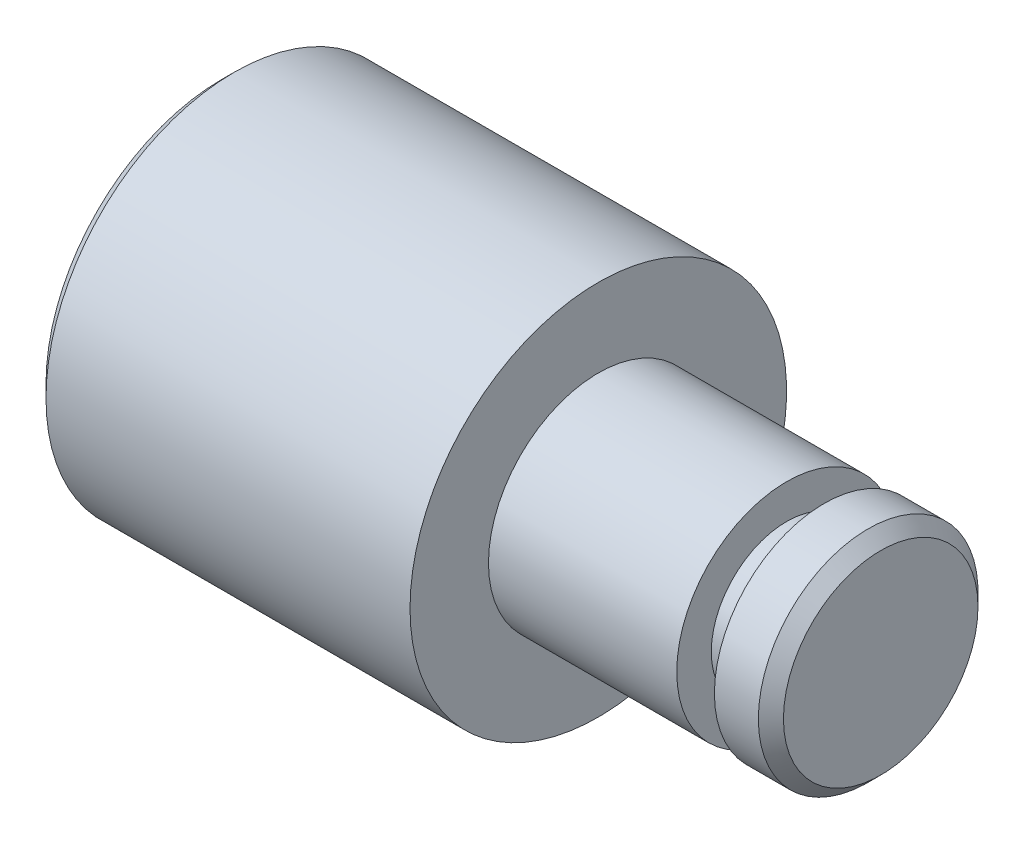
ISO-10303-21;
HEADER;
FILE_DESCRIPTION(('STEP AP214'),'2;1');
FILE_NAME('part.step','',(''),(''),'','','');
FILE_SCHEMA(('AUTOMOTIVE_DESIGN { 1 0 10303 214 1 1 1 1 }'));
ENDSEC;
DATA;
#1=APPLICATION_CONTEXT('core data for automotive mechanical design processes');
#2=APPLICATION_PROTOCOL_DEFINITION('international standard','automotive_design',2000,#1);
#3=PRODUCT_CONTEXT('',#1,'mechanical');
#4=PRODUCT('Part','Part','',(#3));
#5=PRODUCT_RELATED_PRODUCT_CATEGORY('part','',(#4));
#6=PRODUCT_DEFINITION_FORMATION('','',#4);
#7=PRODUCT_DEFINITION_CONTEXT('part definition',#1,'design');
#8=PRODUCT_DEFINITION('design','',#6,#7);
#9=PRODUCT_DEFINITION_SHAPE('','',#8);
#10=(LENGTH_UNIT() NAMED_UNIT(*) SI_UNIT(.MILLI.,.METRE.));
#11=(NAMED_UNIT(*) PLANE_ANGLE_UNIT() SI_UNIT($,.RADIAN.));
#12=(NAMED_UNIT(*) SI_UNIT($,.STERADIAN.) SOLID_ANGLE_UNIT());
#13=UNCERTAINTY_MEASURE_WITH_UNIT(LENGTH_MEASURE(1.E-05),#10,'distance_accuracy_value','');
#14=(GEOMETRIC_REPRESENTATION_CONTEXT(3) GLOBAL_UNCERTAINTY_ASSIGNED_CONTEXT((#13)) GLOBAL_UNIT_ASSIGNED_CONTEXT((#10,
#11,#12)) REPRESENTATION_CONTEXT('',''));
#15=CARTESIAN_POINT('',(0.,0.,0.));
#16=DIRECTION('',(0.,0.,1.));
#17=DIRECTION('',(1.,0.,0.));
#18=AXIS2_PLACEMENT_3D('',#15,#16,#17);
#19=CARTESIAN_POINT('',(0.,0.,0.));
#20=DIRECTION('',(-1.,0.,0.));
#21=DIRECTION('',(0.,0.,1.));
#22=AXIS2_PLACEMENT_3D('',#19,#20,#21);
#23=PLANE('',#22);
#24=CARTESIAN_POINT('',(0.,0.,0.));
#25=DIRECTION('',(-1.,0.,0.));
#26=DIRECTION('',(0.,0.,1.));
#27=AXIS2_PLACEMENT_3D('',#24,#25,#26);
#28=CIRCLE('',#27,1.55);
#29=CARTESIAN_POINT('',(0.,0.,1.55));
#30=VERTEX_POINT('',#29);
#31=EDGE_CURVE('E40',#30,#30,#28,.F.);
#32=ORIENTED_EDGE('',*,*,#31,.T.);
#33=EDGE_LOOP('',(#32));
#34=FACE_BOUND('',#33,.T.);
#35=ADVANCED_FACE('F30',(#34),#23,.F.);
#36=CARTESIAN_POINT('',(0.,0.,0.));
#37=DIRECTION('',(-1.,0.,0.));
#38=DIRECTION('',(0.,0.,1.));
#39=AXIS2_PLACEMENT_3D('',#36,#37,#38);
#40=CYLINDRICAL_SURFACE('',#39,1.75);
#41=CARTESIAN_POINT('',(-0.199999999999999,0.,0.));
#42=DIRECTION('',(-1.,0.,0.));
#43=DIRECTION('',(0.,0.,1.));
#44=AXIS2_PLACEMENT_3D('',#41,#42,#43);
#45=CIRCLE('',#44,1.75);
#46=CARTESIAN_POINT('',(-0.199999999999999,0.,1.75));
#47=VERTEX_POINT('',#46);
#48=EDGE_CURVE('E44',#47,#47,#45,.T.);
#49=ORIENTED_EDGE('',*,*,#48,.T.);
#50=EDGE_LOOP('',(#49));
#51=FACE_BOUND('',#50,.T.);
#52=CARTESIAN_POINT('',(-0.900000000000001,0.,0.));
#53=DIRECTION('',(-1.,0.,0.));
#54=DIRECTION('',(0.,0.,1.));
#55=AXIS2_PLACEMENT_3D('',#52,#53,#54);
#56=CIRCLE('',#55,1.75);
#57=CARTESIAN_POINT('',(-0.900000000000001,0.,1.75));
#58=VERTEX_POINT('',#57);
#59=EDGE_CURVE('E49',#58,#58,#56,.T.);
#60=ORIENTED_EDGE('',*,*,#59,.F.);
#61=EDGE_LOOP('',(#60));
#62=FACE_BOUND('',#61,.T.);
#63=ADVANCED_FACE('F97',(#51,#62),#40,.T.);
#64=CARTESIAN_POINT('',(-0.900000000000001,1.75,0.));
#65=DIRECTION('',(1.,0.,0.));
#66=DIRECTION('',(0.,0.,-1.));
#67=AXIS2_PLACEMENT_3D('',#64,#65,#66);
#68=PLANE('',#67);
#69=CARTESIAN_POINT('',(-0.900000000000001,0.,0.));
#70=DIRECTION('',(-1.,0.,0.));
#71=DIRECTION('',(0.,0.,1.));
#72=AXIS2_PLACEMENT_3D('',#69,#70,#71);
#73=CIRCLE('',#72,1.2);
#74=CARTESIAN_POINT('',(-0.900000000000001,0.,1.2));
#75=VERTEX_POINT('',#74);
#76=EDGE_CURVE('E52',#75,#75,#73,.T.);
#77=ORIENTED_EDGE('',*,*,#76,.F.);
#78=EDGE_LOOP('',(#77));
#79=FACE_BOUND('',#78,.T.);
#80=ORIENTED_EDGE('',*,*,#59,.T.);
#81=EDGE_LOOP('',(#80));
#82=FACE_BOUND('',#81,.T.);
#83=ADVANCED_FACE('F91',(#79,#82),#68,.F.);
#84=CARTESIAN_POINT('',(0.,0.,0.));
#85=DIRECTION('',(-1.,0.,0.));
#86=DIRECTION('',(0.,0.,1.));
#87=AXIS2_PLACEMENT_3D('',#84,#85,#86);
#88=CYLINDRICAL_SURFACE('',#87,1.2);
#89=CARTESIAN_POINT('',(-1.5,0.,0.));
#90=DIRECTION('',(-1.,0.,0.));
#91=DIRECTION('',(0.,0.,1.));
#92=AXIS2_PLACEMENT_3D('',#89,#90,#91);
#93=CIRCLE('',#92,1.2);
#94=CARTESIAN_POINT('',(-1.5,0.,1.2));
#95=VERTEX_POINT('',#94);
#96=EDGE_CURVE('E55',#95,#95,#93,.T.);
#97=ORIENTED_EDGE('',*,*,#96,.F.);
#98=EDGE_LOOP('',(#97));
#99=FACE_BOUND('',#98,.T.);
#100=ORIENTED_EDGE('',*,*,#76,.T.);
#101=EDGE_LOOP('',(#100));
#102=FACE_BOUND('',#101,.T.);
#103=ADVANCED_FACE('F85',(#99,#102),#88,.T.);
#104=CARTESIAN_POINT('',(-1.5,1.2,0.));
#105=DIRECTION('',(-1.,0.,0.));
#106=DIRECTION('',(0.,0.,1.));
#107=AXIS2_PLACEMENT_3D('',#104,#105,#106);
#108=PLANE('',#107);
#109=CARTESIAN_POINT('',(-1.5,0.,0.));
#110=DIRECTION('',(-1.,0.,0.));
#111=DIRECTION('',(0.,0.,1.));
#112=AXIS2_PLACEMENT_3D('',#109,#110,#111);
#113=CIRCLE('',#112,1.75);
#114=CARTESIAN_POINT('',(-1.5,0.,1.75));
#115=VERTEX_POINT('',#114);
#116=EDGE_CURVE('E58',#115,#115,#113,.T.);
#117=ORIENTED_EDGE('',*,*,#116,.F.);
#118=EDGE_LOOP('',(#117));
#119=FACE_BOUND('',#118,.T.);
#120=ORIENTED_EDGE('',*,*,#96,.T.);
#121=EDGE_LOOP('',(#120));
#122=FACE_BOUND('',#121,.T.);
#123=ADVANCED_FACE('F79',(#119,#122),#108,.F.);
#124=CARTESIAN_POINT('',(0.,0.,0.));
#125=DIRECTION('',(-1.,0.,0.));
#126=DIRECTION('',(0.,0.,1.));
#127=AXIS2_PLACEMENT_3D('',#124,#125,#126);
#128=CYLINDRICAL_SURFACE('',#127,1.75);
#129=CARTESIAN_POINT('',(-4.5,0.,0.));
#130=DIRECTION('',(-1.,0.,0.));
#131=DIRECTION('',(0.,0.,1.));
#132=AXIS2_PLACEMENT_3D('',#129,#130,#131);
#133=CIRCLE('',#132,1.75);
#134=CARTESIAN_POINT('',(-4.5,0.,1.75));
#135=VERTEX_POINT('',#134);
#136=EDGE_CURVE('E61',#135,#135,#133,.T.);
#137=ORIENTED_EDGE('',*,*,#136,.F.);
#138=EDGE_LOOP('',(#137));
#139=FACE_BOUND('',#138,.T.);
#140=ORIENTED_EDGE('',*,*,#116,.T.);
#141=EDGE_LOOP('',(#140));
#142=FACE_BOUND('',#141,.T.);
#143=ADVANCED_FACE('F73',(#139,#142),#128,.T.);
#144=CARTESIAN_POINT('',(-4.5,1.75,0.));
#145=DIRECTION('',(-1.,0.,0.));
#146=DIRECTION('',(0.,0.,1.));
#147=AXIS2_PLACEMENT_3D('',#144,#145,#146);
#148=PLANE('',#147);
#149=CARTESIAN_POINT('',(-4.5,0.,0.));
#150=DIRECTION('',(-1.,0.,0.));
#151=DIRECTION('',(0.,0.,1.));
#152=AXIS2_PLACEMENT_3D('',#149,#150,#151);
#153=CIRCLE('',#152,3.);
#154=CARTESIAN_POINT('',(-4.5,0.,3.));
#155=VERTEX_POINT('',#154);
#156=EDGE_CURVE('E64',#155,#155,#153,.T.);
#157=ORIENTED_EDGE('',*,*,#156,.F.);
#158=EDGE_LOOP('',(#157));
#159=FACE_BOUND('',#158,.T.);
#160=ORIENTED_EDGE('',*,*,#136,.T.);
#161=EDGE_LOOP('',(#160));
#162=FACE_BOUND('',#161,.T.);
#163=ADVANCED_FACE('F70',(#159,#162),#148,.F.);
#164=CARTESIAN_POINT('',(0.,0.,0.));
#165=DIRECTION('',(-1.,0.,0.));
#166=DIRECTION('',(0.,0.,1.));
#167=AXIS2_PLACEMENT_3D('',#164,#165,#166);
#168=CYLINDRICAL_SURFACE('',#167,3.);
#169=CARTESIAN_POINT('',(-10.3,0.,0.));
#170=DIRECTION('',(1.,0.,0.));
#171=DIRECTION('',(0.,0.,-1.));
#172=AXIS2_PLACEMENT_3D('',#169,#170,#171);
#173=CIRCLE('',#172,3.);
#174=CARTESIAN_POINT('',(-10.3,0.,-3.));
#175=VERTEX_POINT('',#174);
#176=EDGE_CURVE('E10',#175,#175,#173,.T.);
#177=ORIENTED_EDGE('',*,*,#176,.T.);
#178=EDGE_LOOP('',(#177));
#179=FACE_BOUND('',#178,.T.);
#180=ORIENTED_EDGE('',*,*,#156,.T.);
#181=EDGE_LOOP('',(#180));
#182=FACE_BOUND('',#181,.T.);
#183=ADVANCED_FACE('F68',(#179,#182),#168,.T.);
#184=CARTESIAN_POINT('',(-10.5,3.,0.));
#185=DIRECTION('',(1.,0.,0.));
#186=DIRECTION('',(0.,0.,-1.));
#187=AXIS2_PLACEMENT_3D('',#184,#185,#186);
#188=PLANE('',#187);
#189=CARTESIAN_POINT('',(-10.5,0.,0.));
#190=DIRECTION('',(1.,0.,0.));
#191=DIRECTION('',(0.,0.,-1.));
#192=AXIS2_PLACEMENT_3D('',#189,#190,#191);
#193=CIRCLE('',#192,2.8);
#194=CARTESIAN_POINT('',(-10.5,0.,-2.8));
#195=VERTEX_POINT('',#194);
#196=EDGE_CURVE('E36',#195,#195,#193,.F.);
#197=ORIENTED_EDGE('',*,*,#196,.T.);
#198=EDGE_LOOP('',(#197));
#199=FACE_BOUND('',#198,.T.);
#200=ADVANCED_FACE('F110',(#199),#188,.F.);
#201=CARTESIAN_POINT('',(-0.199999999999999,0.,0.));
#202=DIRECTION('',(-1.,0.,0.));
#203=DIRECTION('',(0.,0.,1.));
#204=AXIS2_PLACEMENT_3D('',#201,#202,#203);
#205=CONICAL_SURFACE('',#204,1.75,0.785398163397449);
#206=ORIENTED_EDGE('',*,*,#31,.F.);
#207=EDGE_LOOP('',(#206));
#208=FACE_BOUND('',#207,.T.);
#209=ORIENTED_EDGE('',*,*,#48,.F.);
#210=EDGE_LOOP('',(#209));
#211=FACE_BOUND('',#210,.T.);
#212=ADVANCED_FACE('F113',(#208,#211),#205,.T.);
#213=CARTESIAN_POINT('',(-10.5,0.,0.));
#214=DIRECTION('',(1.,0.,0.));
#215=DIRECTION('',(0.,0.,-1.));
#216=AXIS2_PLACEMENT_3D('',#213,#214,#215);
#217=CONICAL_SURFACE('',#216,2.8,0.785398163397442);
#218=ORIENTED_EDGE('',*,*,#176,.F.);
#219=EDGE_LOOP('',(#218));
#220=FACE_BOUND('',#219,.T.);
#221=ORIENTED_EDGE('',*,*,#196,.F.);
#222=EDGE_LOOP('',(#221));
#223=FACE_BOUND('',#222,.T.);
#224=ADVANCED_FACE('F116',(#220,#223),#217,.T.);
#225=CLOSED_SHELL('',(#35,#63,#83,#103,#123,#143,#163,#183,#200,#212,#224));
#226=MANIFOLD_SOLID_BREP('B2',#225);
#227=ADVANCED_BREP_SHAPE_REPRESENTATION('',(#18,#226),#14);
#228=SHAPE_DEFINITION_REPRESENTATION(#9,#227);
ENDSEC;
END-ISO-10303-21;
